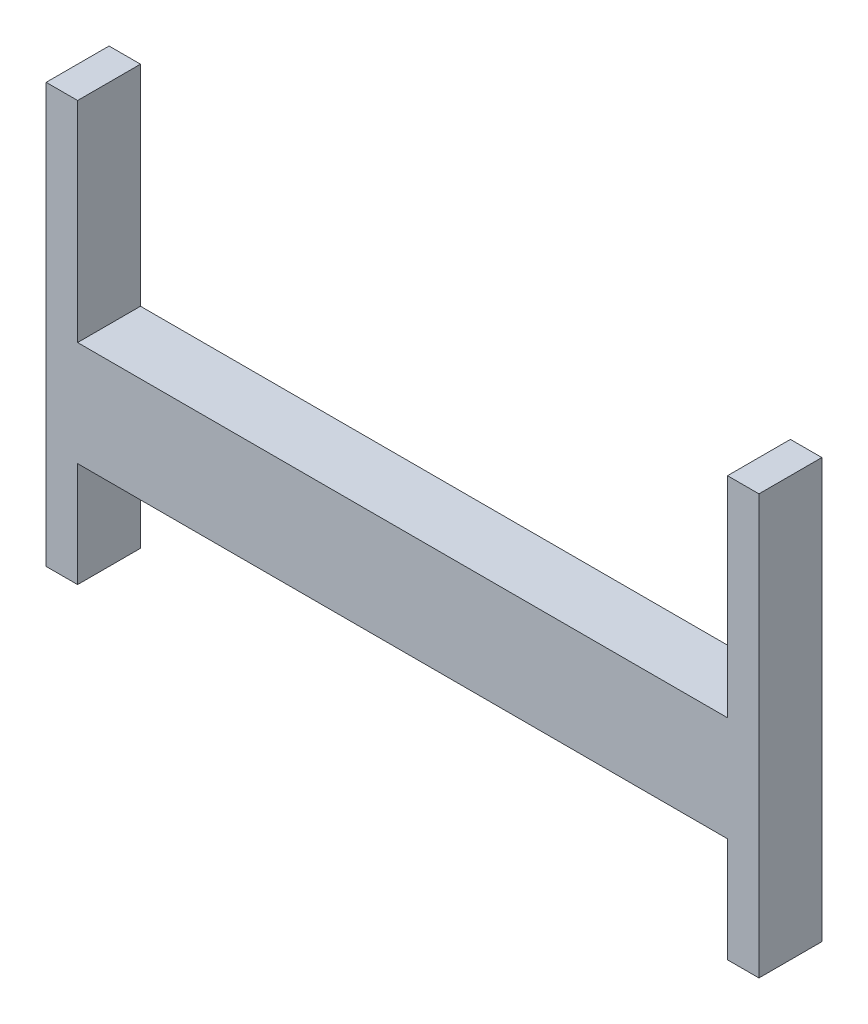
ISO-10303-21;
HEADER;
FILE_DESCRIPTION(('STEP AP214'),'2;1');
FILE_NAME('part.step','',(''),(''),'','','');
FILE_SCHEMA(('AUTOMOTIVE_DESIGN { 1 0 10303 214 1 1 1 1 }'));
ENDSEC;
DATA;
#1=APPLICATION_CONTEXT('core data for automotive mechanical design processes');
#2=APPLICATION_PROTOCOL_DEFINITION('international standard','automotive_design',2000,#1);
#3=PRODUCT_CONTEXT('',#1,'mechanical');
#4=PRODUCT('Part','Part','',(#3));
#5=PRODUCT_RELATED_PRODUCT_CATEGORY('part','',(#4));
#6=PRODUCT_DEFINITION_FORMATION('','',#4);
#7=PRODUCT_DEFINITION_CONTEXT('part definition',#1,'design');
#8=PRODUCT_DEFINITION('design','',#6,#7);
#9=PRODUCT_DEFINITION_SHAPE('','',#8);
#10=(LENGTH_UNIT() NAMED_UNIT(*) SI_UNIT(.MILLI.,.METRE.));
#11=(NAMED_UNIT(*) PLANE_ANGLE_UNIT() SI_UNIT($,.RADIAN.));
#12=(NAMED_UNIT(*) SI_UNIT($,.STERADIAN.) SOLID_ANGLE_UNIT());
#13=UNCERTAINTY_MEASURE_WITH_UNIT(LENGTH_MEASURE(1.E-05),#10,'distance_accuracy_value','');
#14=(GEOMETRIC_REPRESENTATION_CONTEXT(3) GLOBAL_UNCERTAINTY_ASSIGNED_CONTEXT((#13)) GLOBAL_UNIT_ASSIGNED_CONTEXT((#10,
#11,#12)) REPRESENTATION_CONTEXT('',''));
#15=CARTESIAN_POINT('',(0.,0.,0.));
#16=DIRECTION('',(0.,0.,1.));
#17=DIRECTION('',(1.,0.,0.));
#18=AXIS2_PLACEMENT_3D('',#15,#16,#17);
#19=CARTESIAN_POINT('',(-155.,25.,30.));
#20=DIRECTION('',(-1.,0.,0.));
#21=DIRECTION('',(0.,0.,1.));
#22=AXIS2_PLACEMENT_3D('',#19,#20,#21);
#23=PLANE('',#22);
#24=DIRECTION('',(0.,1.,0.));
#25=VECTOR('',#24,1.);
#26=CARTESIAN_POINT('',(-155.,25.,0.));
#27=LINE('',#26,#25);
#28=CARTESIAN_POINT('',(-155.,25.,0.));
#29=VERTEX_POINT('',#28);
#30=CARTESIAN_POINT('',(-155.,125.,0.));
#31=VERTEX_POINT('',#30);
#32=EDGE_CURVE('E153',#29,#31,#27,.T.);
#33=ORIENTED_EDGE('',*,*,#32,.T.);
#34=DIRECTION('',(0.,0.,-1.));
#35=VECTOR('',#34,1.);
#36=CARTESIAN_POINT('',(-155.,125.,30.));
#37=LINE('',#36,#35);
#38=CARTESIAN_POINT('',(-155.,125.,30.));
#39=VERTEX_POINT('',#38);
#40=EDGE_CURVE('E11',#39,#31,#37,.T.);
#41=ORIENTED_EDGE('',*,*,#40,.F.);
#42=DIRECTION('',(0.,1.,0.));
#43=VECTOR('',#42,1.);
#44=CARTESIAN_POINT('',(-155.,25.,30.));
#45=LINE('',#44,#43);
#46=CARTESIAN_POINT('',(-155.,25.,30.));
#47=VERTEX_POINT('',#46);
#48=EDGE_CURVE('E177',#47,#39,#45,.T.);
#49=ORIENTED_EDGE('',*,*,#48,.F.);
#50=DIRECTION('',(0.,0.,-1.));
#51=VECTOR('',#50,1.);
#52=CARTESIAN_POINT('',(-155.,25.,30.));
#53=LINE('',#52,#51);
#54=EDGE_CURVE('E149',#47,#29,#53,.T.);
#55=ORIENTED_EDGE('',*,*,#54,.T.);
#56=EDGE_LOOP('',(#33,#41,#49,#55));
#57=FACE_BOUND('',#56,.T.);
#58=ADVANCED_FACE('F33',(#57),#23,.F.);
#59=CARTESIAN_POINT('',(-155.,125.,30.));
#60=DIRECTION('',(0.,-1.,0.));
#61=DIRECTION('',(0.,0.,-1.));
#62=AXIS2_PLACEMENT_3D('',#59,#60,#61);
#63=PLANE('',#62);
#64=DIRECTION('',(-1.,0.,0.));
#65=VECTOR('',#64,1.);
#66=CARTESIAN_POINT('',(-155.,125.,0.));
#67=LINE('',#66,#65);
#68=CARTESIAN_POINT('',(-170.,125.,0.));
#69=VERTEX_POINT('',#68);
#70=EDGE_CURVE('E156',#31,#69,#67,.T.);
#71=ORIENTED_EDGE('',*,*,#70,.T.);
#72=DIRECTION('',(0.,0.,-1.));
#73=VECTOR('',#72,1.);
#74=CARTESIAN_POINT('',(-170.,125.,30.));
#75=LINE('',#74,#73);
#76=CARTESIAN_POINT('',(-170.,125.,30.));
#77=VERTEX_POINT('',#76);
#78=EDGE_CURVE('E41',#77,#69,#75,.T.);
#79=ORIENTED_EDGE('',*,*,#78,.F.);
#80=DIRECTION('',(-1.,0.,0.));
#81=VECTOR('',#80,1.);
#82=CARTESIAN_POINT('',(-155.,125.,30.));
#83=LINE('',#82,#81);
#84=EDGE_CURVE('E104',#39,#77,#83,.T.);
#85=ORIENTED_EDGE('',*,*,#84,.F.);
#86=ORIENTED_EDGE('',*,*,#40,.T.);
#87=EDGE_LOOP('',(#71,#79,#85,#86));
#88=FACE_BOUND('',#87,.T.);
#89=ADVANCED_FACE('F204',(#88),#63,.F.);
#90=CARTESIAN_POINT('',(-170.,-25.,30.));
#91=DIRECTION('',(1.,0.,0.));
#92=DIRECTION('',(0.,1.,0.));
#93=AXIS2_PLACEMENT_3D('',#90,#91,#92);
#94=PLANE('',#93);
#95=DIRECTION('',(0.,-1.,0.));
#96=VECTOR('',#95,1.);
#97=CARTESIAN_POINT('',(-170.,-25.,0.));
#98=LINE('',#97,#96);
#99=CARTESIAN_POINT('',(-170.,-75.,0.));
#100=VERTEX_POINT('',#99);
#101=EDGE_CURVE('E159',#69,#100,#98,.T.);
#102=ORIENTED_EDGE('',*,*,#101,.T.);
#103=DIRECTION('',(0.,0.,-1.));
#104=VECTOR('',#103,1.);
#105=CARTESIAN_POINT('',(-170.,-75.,30.));
#106=LINE('',#105,#104);
#107=CARTESIAN_POINT('',(-170.,-75.,30.));
#108=VERTEX_POINT('',#107);
#109=EDGE_CURVE('E196',#108,#100,#106,.T.);
#110=ORIENTED_EDGE('',*,*,#109,.F.);
#111=DIRECTION('',(0.,-1.,0.));
#112=VECTOR('',#111,1.);
#113=CARTESIAN_POINT('',(-170.,-25.,30.));
#114=LINE('',#113,#112);
#115=EDGE_CURVE('E203',#77,#108,#114,.T.);
#116=ORIENTED_EDGE('',*,*,#115,.F.);
#117=ORIENTED_EDGE('',*,*,#78,.T.);
#118=EDGE_LOOP('',(#102,#110,#116,#117));
#119=FACE_BOUND('',#118,.T.);
#120=ADVANCED_FACE('F201',(#119),#94,.F.);
#121=CARTESIAN_POINT('',(-170.,-75.,30.));
#122=DIRECTION('',(0.,1.,0.));
#123=DIRECTION('',(0.,0.,1.));
#124=AXIS2_PLACEMENT_3D('',#121,#122,#123);
#125=PLANE('',#124);
#126=DIRECTION('',(1.,0.,0.));
#127=VECTOR('',#126,1.);
#128=CARTESIAN_POINT('',(-170.,-75.,0.));
#129=LINE('',#128,#127);
#130=CARTESIAN_POINT('',(-155.,-75.,0.));
#131=VERTEX_POINT('',#130);
#132=EDGE_CURVE('E161',#100,#131,#129,.T.);
#133=ORIENTED_EDGE('',*,*,#132,.T.);
#134=DIRECTION('',(0.,0.,-1.));
#135=VECTOR('',#134,1.);
#136=CARTESIAN_POINT('',(-155.,-75.,30.));
#137=LINE('',#136,#135);
#138=CARTESIAN_POINT('',(-155.,-75.,30.));
#139=VERTEX_POINT('',#138);
#140=EDGE_CURVE('E193',#139,#131,#137,.T.);
#141=ORIENTED_EDGE('',*,*,#140,.F.);
#142=DIRECTION('',(1.,0.,0.));
#143=VECTOR('',#142,1.);
#144=CARTESIAN_POINT('',(-170.,-75.,30.));
#145=LINE('',#144,#143);
#146=EDGE_CURVE('E223',#108,#139,#145,.T.);
#147=ORIENTED_EDGE('',*,*,#146,.F.);
#148=ORIENTED_EDGE('',*,*,#109,.T.);
#149=EDGE_LOOP('',(#133,#141,#147,#148));
#150=FACE_BOUND('',#149,.T.);
#151=ADVANCED_FACE('F214',(#150),#125,.F.);
#152=CARTESIAN_POINT('',(-155.,-25.,30.));
#153=DIRECTION('',(-1.,0.,0.));
#154=DIRECTION('',(0.,0.,1.));
#155=AXIS2_PLACEMENT_3D('',#152,#153,#154);
#156=PLANE('',#155);
#157=DIRECTION('',(0.,1.,0.));
#158=VECTOR('',#157,1.);
#159=CARTESIAN_POINT('',(-155.,-25.,0.));
#160=LINE('',#159,#158);
#161=CARTESIAN_POINT('',(-155.,-25.,0.));
#162=VERTEX_POINT('',#161);
#163=EDGE_CURVE('E163',#131,#162,#160,.T.);
#164=ORIENTED_EDGE('',*,*,#163,.T.);
#165=DIRECTION('',(0.,0.,-1.));
#166=VECTOR('',#165,1.);
#167=CARTESIAN_POINT('',(-155.,-25.,30.));
#168=LINE('',#167,#166);
#169=CARTESIAN_POINT('',(-155.,-25.,30.));
#170=VERTEX_POINT('',#169);
#171=EDGE_CURVE('E190',#170,#162,#168,.T.);
#172=ORIENTED_EDGE('',*,*,#171,.F.);
#173=DIRECTION('',(0.,1.,0.));
#174=VECTOR('',#173,1.);
#175=CARTESIAN_POINT('',(-155.,-25.,30.));
#176=LINE('',#175,#174);
#177=EDGE_CURVE('E220',#139,#170,#176,.T.);
#178=ORIENTED_EDGE('',*,*,#177,.F.);
#179=ORIENTED_EDGE('',*,*,#140,.T.);
#180=EDGE_LOOP('',(#164,#172,#178,#179));
#181=FACE_BOUND('',#180,.T.);
#182=ADVANCED_FACE('F218',(#181),#156,.F.);
#183=CARTESIAN_POINT('',(155.,-25.,30.));
#184=DIRECTION('',(0.,1.,0.));
#185=DIRECTION('',(-1.,0.,0.));
#186=AXIS2_PLACEMENT_3D('',#183,#184,#185);
#187=PLANE('',#186);
#188=DIRECTION('',(1.,0.,0.));
#189=VECTOR('',#188,1.);
#190=CARTESIAN_POINT('',(155.,-25.,0.));
#191=LINE('',#190,#189);
#192=CARTESIAN_POINT('',(155.,-25.,0.));
#193=VERTEX_POINT('',#192);
#194=EDGE_CURVE('E165',#162,#193,#191,.T.);
#195=ORIENTED_EDGE('',*,*,#194,.T.);
#196=DIRECTION('',(0.,0.,-1.));
#197=VECTOR('',#196,1.);
#198=CARTESIAN_POINT('',(155.,-25.,30.));
#199=LINE('',#198,#197);
#200=CARTESIAN_POINT('',(155.,-25.,30.));
#201=VERTEX_POINT('',#200);
#202=EDGE_CURVE('E187',#201,#193,#199,.T.);
#203=ORIENTED_EDGE('',*,*,#202,.F.);
#204=DIRECTION('',(1.,0.,0.));
#205=VECTOR('',#204,1.);
#206=CARTESIAN_POINT('',(155.,-25.,30.));
#207=LINE('',#206,#205);
#208=EDGE_CURVE('E222',#170,#201,#207,.T.);
#209=ORIENTED_EDGE('',*,*,#208,.F.);
#210=ORIENTED_EDGE('',*,*,#171,.T.);
#211=EDGE_LOOP('',(#195,#203,#209,#210));
#212=FACE_BOUND('',#211,.T.);
#213=ADVANCED_FACE('F246',(#212),#187,.F.);
#214=CARTESIAN_POINT('',(155.,-25.,30.));
#215=DIRECTION('',(1.,0.,0.));
#216=DIRECTION('',(0.,0.,-1.));
#217=AXIS2_PLACEMENT_3D('',#214,#215,#216);
#218=PLANE('',#217);
#219=DIRECTION('',(0.,-1.,0.));
#220=VECTOR('',#219,1.);
#221=CARTESIAN_POINT('',(155.,-25.,0.));
#222=LINE('',#221,#220);
#223=CARTESIAN_POINT('',(155.,-75.,0.));
#224=VERTEX_POINT('',#223);
#225=EDGE_CURVE('E167',#193,#224,#222,.T.);
#226=ORIENTED_EDGE('',*,*,#225,.T.);
#227=DIRECTION('',(0.,0.,-1.));
#228=VECTOR('',#227,1.);
#229=CARTESIAN_POINT('',(155.,-75.,30.));
#230=LINE('',#229,#228);
#231=CARTESIAN_POINT('',(155.,-75.,30.));
#232=VERTEX_POINT('',#231);
#233=EDGE_CURVE('E184',#232,#224,#230,.T.);
#234=ORIENTED_EDGE('',*,*,#233,.F.);
#235=DIRECTION('',(0.,-1.,0.));
#236=VECTOR('',#235,1.);
#237=CARTESIAN_POINT('',(155.,-25.,30.));
#238=LINE('',#237,#236);
#239=EDGE_CURVE('E225',#201,#232,#238,.T.);
#240=ORIENTED_EDGE('',*,*,#239,.F.);
#241=ORIENTED_EDGE('',*,*,#202,.T.);
#242=EDGE_LOOP('',(#226,#234,#240,#241));
#243=FACE_BOUND('',#242,.T.);
#244=ADVANCED_FACE('F243',(#243),#218,.F.);
#245=CARTESIAN_POINT('',(170.,-75.,30.));
#246=DIRECTION('',(0.,1.,0.));
#247=DIRECTION('',(0.,0.,1.));
#248=AXIS2_PLACEMENT_3D('',#245,#246,#247);
#249=PLANE('',#248);
#250=DIRECTION('',(1.,0.,0.));
#251=VECTOR('',#250,1.);
#252=CARTESIAN_POINT('',(170.,-75.,0.));
#253=LINE('',#252,#251);
#254=CARTESIAN_POINT('',(170.,-75.,0.));
#255=VERTEX_POINT('',#254);
#256=EDGE_CURVE('E169',#224,#255,#253,.T.);
#257=ORIENTED_EDGE('',*,*,#256,.T.);
#258=DIRECTION('',(0.,0.,-1.));
#259=VECTOR('',#258,1.);
#260=CARTESIAN_POINT('',(170.,-75.,30.));
#261=LINE('',#260,#259);
#262=CARTESIAN_POINT('',(170.,-75.,30.));
#263=VERTEX_POINT('',#262);
#264=EDGE_CURVE('E181',#263,#255,#261,.T.);
#265=ORIENTED_EDGE('',*,*,#264,.F.);
#266=DIRECTION('',(1.,0.,0.));
#267=VECTOR('',#266,1.);
#268=CARTESIAN_POINT('',(170.,-75.,30.));
#269=LINE('',#268,#267);
#270=EDGE_CURVE('E231',#232,#263,#269,.T.);
#271=ORIENTED_EDGE('',*,*,#270,.F.);
#272=ORIENTED_EDGE('',*,*,#233,.T.);
#273=EDGE_LOOP('',(#257,#265,#271,#272));
#274=FACE_BOUND('',#273,.T.);
#275=ADVANCED_FACE('F237',(#274),#249,.F.);
#276=CARTESIAN_POINT('',(170.,-25.,30.));
#277=DIRECTION('',(-1.,0.,0.));
#278=DIRECTION('',(0.,-1.,0.));
#279=AXIS2_PLACEMENT_3D('',#276,#277,#278);
#280=PLANE('',#279);
#281=DIRECTION('',(0.,1.,0.));
#282=VECTOR('',#281,1.);
#283=CARTESIAN_POINT('',(170.,-25.,0.));
#284=LINE('',#283,#282);
#285=CARTESIAN_POINT('',(170.,125.,0.));
#286=VERTEX_POINT('',#285);
#287=EDGE_CURVE('E172',#255,#286,#284,.T.);
#288=ORIENTED_EDGE('',*,*,#287,.T.);
#289=DIRECTION('',(0.,0.,-1.));
#290=VECTOR('',#289,1.);
#291=CARTESIAN_POINT('',(170.,125.,30.));
#292=LINE('',#291,#290);
#293=CARTESIAN_POINT('',(170.,125.,30.));
#294=VERTEX_POINT('',#293);
#295=EDGE_CURVE('E144',#294,#286,#292,.T.);
#296=ORIENTED_EDGE('',*,*,#295,.F.);
#297=DIRECTION('',(0.,1.,0.));
#298=VECTOR('',#297,1.);
#299=CARTESIAN_POINT('',(170.,-25.,30.));
#300=LINE('',#299,#298);
#301=EDGE_CURVE('E135',#263,#294,#300,.T.);
#302=ORIENTED_EDGE('',*,*,#301,.F.);
#303=ORIENTED_EDGE('',*,*,#264,.T.);
#304=EDGE_LOOP('',(#288,#296,#302,#303));
#305=FACE_BOUND('',#304,.T.);
#306=ADVANCED_FACE('F240',(#305),#280,.F.);
#307=CARTESIAN_POINT('',(155.,125.,30.));
#308=DIRECTION('',(0.,-1.,0.));
#309=DIRECTION('',(0.,0.,-1.));
#310=AXIS2_PLACEMENT_3D('',#307,#308,#309);
#311=PLANE('',#310);
#312=DIRECTION('',(-1.,0.,0.));
#313=VECTOR('',#312,1.);
#314=CARTESIAN_POINT('',(155.,125.,0.));
#315=LINE('',#314,#313);
#316=CARTESIAN_POINT('',(155.,125.,0.));
#317=VERTEX_POINT('',#316);
#318=EDGE_CURVE('E143',#286,#317,#315,.T.);
#319=ORIENTED_EDGE('',*,*,#318,.T.);
#320=DIRECTION('',(0.,0.,-1.));
#321=VECTOR('',#320,1.);
#322=CARTESIAN_POINT('',(155.,125.,30.));
#323=LINE('',#322,#321);
#324=CARTESIAN_POINT('',(155.,125.,30.));
#325=VERTEX_POINT('',#324);
#326=EDGE_CURVE('E140',#325,#317,#323,.T.);
#327=ORIENTED_EDGE('',*,*,#326,.F.);
#328=DIRECTION('',(-1.,0.,0.));
#329=VECTOR('',#328,1.);
#330=CARTESIAN_POINT('',(155.,125.,30.));
#331=LINE('',#330,#329);
#332=EDGE_CURVE('E129',#294,#325,#331,.T.);
#333=ORIENTED_EDGE('',*,*,#332,.F.);
#334=ORIENTED_EDGE('',*,*,#295,.T.);
#335=EDGE_LOOP('',(#319,#327,#333,#334));
#336=FACE_BOUND('',#335,.T.);
#337=ADVANCED_FACE('F141',(#336),#311,.F.);
#338=CARTESIAN_POINT('',(155.,25.,30.));
#339=DIRECTION('',(1.,0.,0.));
#340=DIRECTION('',(0.,0.,-1.));
#341=AXIS2_PLACEMENT_3D('',#338,#339,#340);
#342=PLANE('',#341);
#343=DIRECTION('',(0.,-1.,0.));
#344=VECTOR('',#343,1.);
#345=CARTESIAN_POINT('',(155.,25.,0.));
#346=LINE('',#345,#344);
#347=CARTESIAN_POINT('',(155.,25.,0.));
#348=VERTEX_POINT('',#347);
#349=EDGE_CURVE('E90',#317,#348,#346,.T.);
#350=ORIENTED_EDGE('',*,*,#349,.T.);
#351=DIRECTION('',(0.,0.,-1.));
#352=VECTOR('',#351,1.);
#353=CARTESIAN_POINT('',(155.,25.,30.));
#354=LINE('',#353,#352);
#355=CARTESIAN_POINT('',(155.,25.,30.));
#356=VERTEX_POINT('',#355);
#357=EDGE_CURVE('E145',#356,#348,#354,.T.);
#358=ORIENTED_EDGE('',*,*,#357,.F.);
#359=DIRECTION('',(0.,-1.,0.));
#360=VECTOR('',#359,1.);
#361=CARTESIAN_POINT('',(155.,25.,30.));
#362=LINE('',#361,#360);
#363=EDGE_CURVE('E133',#325,#356,#362,.T.);
#364=ORIENTED_EDGE('',*,*,#363,.F.);
#365=ORIENTED_EDGE('',*,*,#326,.T.);
#366=EDGE_LOOP('',(#350,#358,#364,#365));
#367=FACE_BOUND('',#366,.T.);
#368=ADVANCED_FACE('F147',(#367),#342,.F.);
#369=CARTESIAN_POINT('',(155.,25.,30.));
#370=DIRECTION('',(0.,-1.,0.));
#371=DIRECTION('',(1.,0.,0.));
#372=AXIS2_PLACEMENT_3D('',#369,#370,#371);
#373=PLANE('',#372);
#374=DIRECTION('',(-1.,0.,0.));
#375=VECTOR('',#374,1.);
#376=CARTESIAN_POINT('',(155.,25.,0.));
#377=LINE('',#376,#375);
#378=EDGE_CURVE('E96',#348,#29,#377,.T.);
#379=ORIENTED_EDGE('',*,*,#378,.T.);
#380=ORIENTED_EDGE('',*,*,#54,.F.);
#381=DIRECTION('',(-1.,0.,0.));
#382=VECTOR('',#381,1.);
#383=CARTESIAN_POINT('',(155.,25.,30.));
#384=LINE('',#383,#382);
#385=EDGE_CURVE('E49',#356,#47,#384,.T.);
#386=ORIENTED_EDGE('',*,*,#385,.F.);
#387=ORIENTED_EDGE('',*,*,#357,.T.);
#388=EDGE_LOOP('',(#379,#380,#386,#387));
#389=FACE_BOUND('',#388,.T.);
#390=ADVANCED_FACE('F261',(#389),#373,.F.);
#391=CARTESIAN_POINT('',(0.,0.,30.));
#392=DIRECTION('',(0.,0.,1.));
#393=DIRECTION('',(1.,0.,0.));
#394=AXIS2_PLACEMENT_3D('',#391,#392,#393);
#395=PLANE('',#394);
#396=ORIENTED_EDGE('',*,*,#48,.T.);
#397=ORIENTED_EDGE('',*,*,#84,.T.);
#398=ORIENTED_EDGE('',*,*,#115,.T.);
#399=ORIENTED_EDGE('',*,*,#146,.T.);
#400=ORIENTED_EDGE('',*,*,#177,.T.);
#401=ORIENTED_EDGE('',*,*,#208,.T.);
#402=ORIENTED_EDGE('',*,*,#239,.T.);
#403=ORIENTED_EDGE('',*,*,#270,.T.);
#404=ORIENTED_EDGE('',*,*,#301,.T.);
#405=ORIENTED_EDGE('',*,*,#332,.T.);
#406=ORIENTED_EDGE('',*,*,#363,.T.);
#407=ORIENTED_EDGE('',*,*,#385,.T.);
#408=EDGE_LOOP('',(#396,#397,#398,#399,#400,#401,#402,#403,#404,#405,#406,#407));
#409=FACE_BOUND('',#408,.T.);
#410=ADVANCED_FACE('F131',(#409),#395,.T.);
#411=CARTESIAN_POINT('',(0.,0.,0.));
#412=DIRECTION('',(0.,0.,1.));
#413=DIRECTION('',(1.,0.,0.));
#414=AXIS2_PLACEMENT_3D('',#411,#412,#413);
#415=PLANE('',#414);
#416=ORIENTED_EDGE('',*,*,#32,.F.);
#417=ORIENTED_EDGE('',*,*,#378,.F.);
#418=ORIENTED_EDGE('',*,*,#349,.F.);
#419=ORIENTED_EDGE('',*,*,#318,.F.);
#420=ORIENTED_EDGE('',*,*,#287,.F.);
#421=ORIENTED_EDGE('',*,*,#256,.F.);
#422=ORIENTED_EDGE('',*,*,#225,.F.);
#423=ORIENTED_EDGE('',*,*,#194,.F.);
#424=ORIENTED_EDGE('',*,*,#163,.F.);
#425=ORIENTED_EDGE('',*,*,#132,.F.);
#426=ORIENTED_EDGE('',*,*,#101,.F.);
#427=ORIENTED_EDGE('',*,*,#70,.F.);
#428=EDGE_LOOP('',(#416,#417,#418,#419,#420,#421,#422,#423,#424,#425,#426,#427));
#429=FACE_BOUND('',#428,.T.);
#430=ADVANCED_FACE('F208',(#429),#415,.F.);
#431=CLOSED_SHELL('',(#58,#89,#120,#151,#182,#213,#244,#275,#306,#337,#368,#390,#410,#430));
#432=MANIFOLD_SOLID_BREP('B2',#431);
#433=ADVANCED_BREP_SHAPE_REPRESENTATION('',(#18,#432),#14);
#434=SHAPE_DEFINITION_REPRESENTATION(#9,#433);
ENDSEC;
END-ISO-10303-21;
